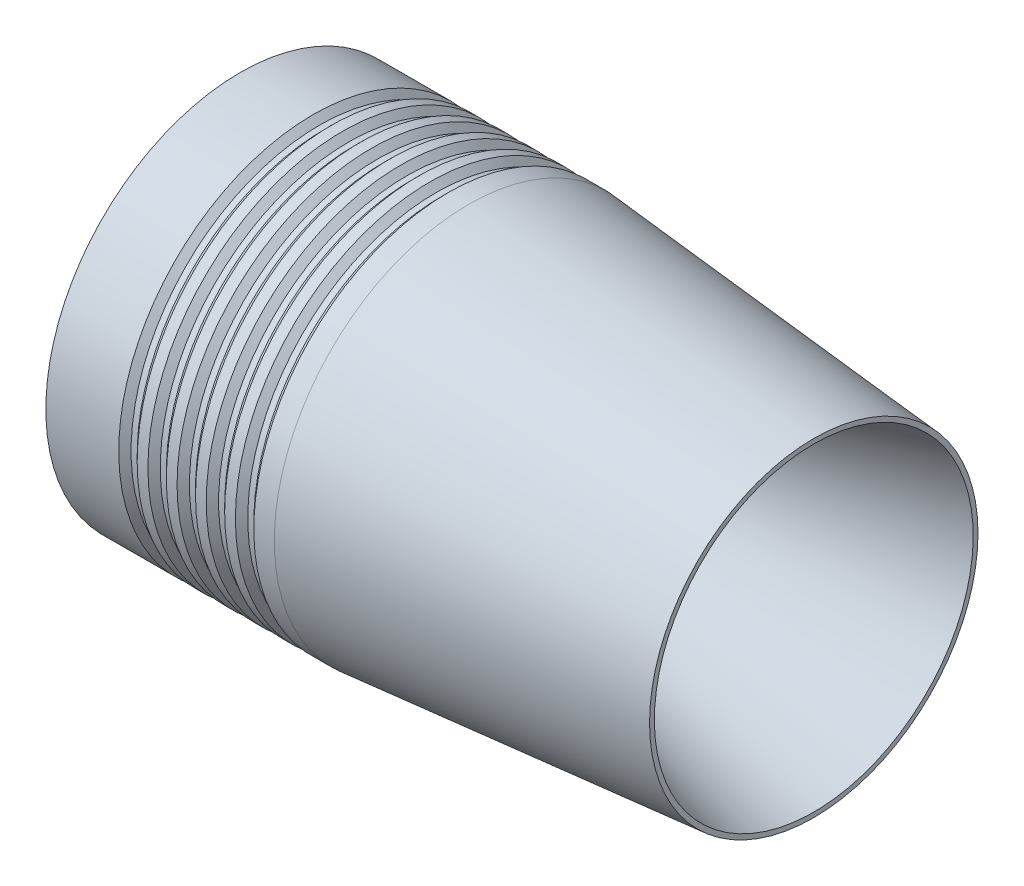
ISO-10303-21;
HEADER;
FILE_DESCRIPTION(('STEP AP214'),'2;1');
FILE_NAME('part.step','',(''),(''),'','','');
FILE_SCHEMA(('AUTOMOTIVE_DESIGN { 1 0 10303 214 1 1 1 1 }'));
ENDSEC;
DATA;
#1=APPLICATION_CONTEXT('core data for automotive mechanical design processes');
#2=APPLICATION_PROTOCOL_DEFINITION('international standard','automotive_design',2000,#1);
#3=PRODUCT_CONTEXT('',#1,'mechanical');
#4=PRODUCT('Part','Part','',(#3));
#5=PRODUCT_RELATED_PRODUCT_CATEGORY('part','',(#4));
#6=PRODUCT_DEFINITION_FORMATION('','',#4);
#7=PRODUCT_DEFINITION_CONTEXT('part definition',#1,'design');
#8=PRODUCT_DEFINITION('design','',#6,#7);
#9=PRODUCT_DEFINITION_SHAPE('','',#8);
#10=(LENGTH_UNIT() NAMED_UNIT(*) SI_UNIT(.MILLI.,.METRE.));
#11=(NAMED_UNIT(*) PLANE_ANGLE_UNIT() SI_UNIT($,.RADIAN.));
#12=(NAMED_UNIT(*) SI_UNIT($,.STERADIAN.) SOLID_ANGLE_UNIT());
#13=UNCERTAINTY_MEASURE_WITH_UNIT(LENGTH_MEASURE(1.E-05),#10,'distance_accuracy_value','');
#14=(GEOMETRIC_REPRESENTATION_CONTEXT(3) GLOBAL_UNCERTAINTY_ASSIGNED_CONTEXT((#13)) GLOBAL_UNIT_ASSIGNED_CONTEXT((#10,
#11,#12)) REPRESENTATION_CONTEXT('',''));
#15=CARTESIAN_POINT('',(0.,0.,0.));
#16=DIRECTION('',(0.,0.,1.));
#17=DIRECTION('',(1.,0.,0.));
#18=AXIS2_PLACEMENT_3D('',#15,#16,#17);
#19=CARTESIAN_POINT('',(0.,0.,0.));
#20=DIRECTION('',(1.,0.,0.));
#21=DIRECTION('',(0.,1.,0.));
#22=AXIS2_PLACEMENT_3D('',#19,#20,#21);
#23=CYLINDRICAL_SURFACE('',#22,50.8);
#24=CARTESIAN_POINT('',(-12.9667000000001,0.,0.));
#25=DIRECTION('',(1.,0.,0.));
#26=DIRECTION('',(0.,0.,-1.));
#27=AXIS2_PLACEMENT_3D('',#24,#25,#26);
#28=CIRCLE('',#27,50.8);
#29=CARTESIAN_POINT('',(-12.9667000000001,0.,-50.8));
#30=VERTEX_POINT('',#29);
#31=EDGE_CURVE('E105',#30,#30,#28,.T.);
#32=ORIENTED_EDGE('',*,*,#31,.T.);
#33=EDGE_LOOP('',(#32));
#34=FACE_BOUND('',#33,.T.);
#35=CARTESIAN_POINT('',(-10.16,0.,0.));
#36=DIRECTION('',(1.,0.,0.));
#37=DIRECTION('',(0.,0.,-1.));
#38=AXIS2_PLACEMENT_3D('',#35,#36,#37);
#39=CIRCLE('',#38,50.8);
#40=CARTESIAN_POINT('',(-10.16,0.,-50.8));
#41=VERTEX_POINT('',#40);
#42=EDGE_CURVE('E120',#41,#41,#39,.T.);
#43=ORIENTED_EDGE('',*,*,#42,.F.);
#44=EDGE_LOOP('',(#43));
#45=FACE_BOUND('',#44,.T.);
#46=ADVANCED_FACE('F34',(#34,#45),#23,.T.);
#47=CARTESIAN_POINT('',(-20.5867000000001,0.,0.));
#48=DIRECTION('',(1.,0.,0.));
#49=DIRECTION('',(0.,0.,-1.));
#50=AXIS2_PLACEMENT_3D('',#47,#48,#49);
#51=CIRCLE('',#50,50.8);
#52=CARTESIAN_POINT('',(-20.5867000000001,0.,-50.8));
#53=VERTEX_POINT('',#52);
#54=EDGE_CURVE('E93',#53,#53,#51,.T.);
#55=ORIENTED_EDGE('',*,*,#54,.T.);
#56=EDGE_LOOP('',(#55));
#57=FACE_BOUND('',#56,.T.);
#58=CARTESIAN_POINT('',(-17.78,0.,0.));
#59=DIRECTION('',(1.,0.,0.));
#60=DIRECTION('',(0.,0.,-1.));
#61=AXIS2_PLACEMENT_3D('',#58,#59,#60);
#62=CIRCLE('',#61,50.8);
#63=CARTESIAN_POINT('',(-17.78,0.,-50.8));
#64=VERTEX_POINT('',#63);
#65=EDGE_CURVE('E108',#64,#64,#62,.T.);
#66=ORIENTED_EDGE('',*,*,#65,.F.);
#67=EDGE_LOOP('',(#66));
#68=FACE_BOUND('',#67,.T.);
#69=ADVANCED_FACE('F143',(#57,#68),#23,.T.);
#70=CARTESIAN_POINT('',(-28.2067000000001,0.,0.));
#71=DIRECTION('',(1.,0.,0.));
#72=DIRECTION('',(0.,0.,-1.));
#73=AXIS2_PLACEMENT_3D('',#70,#71,#72);
#74=CIRCLE('',#73,50.8);
#75=CARTESIAN_POINT('',(-28.2067000000001,0.,-50.8));
#76=VERTEX_POINT('',#75);
#77=EDGE_CURVE('E81',#76,#76,#74,.T.);
#78=ORIENTED_EDGE('',*,*,#77,.T.);
#79=EDGE_LOOP('',(#78));
#80=FACE_BOUND('',#79,.T.);
#81=CARTESIAN_POINT('',(-25.4,0.,0.));
#82=DIRECTION('',(1.,0.,0.));
#83=DIRECTION('',(0.,0.,-1.));
#84=AXIS2_PLACEMENT_3D('',#81,#82,#83);
#85=CIRCLE('',#84,50.8);
#86=CARTESIAN_POINT('',(-25.4,0.,-50.8));
#87=VERTEX_POINT('',#86);
#88=EDGE_CURVE('E96',#87,#87,#85,.T.);
#89=ORIENTED_EDGE('',*,*,#88,.F.);
#90=EDGE_LOOP('',(#89));
#91=FACE_BOUND('',#90,.T.);
#92=ADVANCED_FACE('F149',(#80,#91),#23,.T.);
#93=CARTESIAN_POINT('',(-35.8267000000001,0.,0.));
#94=DIRECTION('',(1.,0.,0.));
#95=DIRECTION('',(0.,0.,-1.));
#96=AXIS2_PLACEMENT_3D('',#93,#94,#95);
#97=CIRCLE('',#96,50.8);
#98=CARTESIAN_POINT('',(-35.8267000000001,0.,-50.8));
#99=VERTEX_POINT('',#98);
#100=EDGE_CURVE('E69',#99,#99,#97,.T.);
#101=ORIENTED_EDGE('',*,*,#100,.T.);
#102=EDGE_LOOP('',(#101));
#103=FACE_BOUND('',#102,.T.);
#104=CARTESIAN_POINT('',(-33.02,0.,0.));
#105=DIRECTION('',(1.,0.,0.));
#106=DIRECTION('',(0.,0.,-1.));
#107=AXIS2_PLACEMENT_3D('',#104,#105,#106);
#108=CIRCLE('',#107,50.8);
#109=CARTESIAN_POINT('',(-33.02,0.,-50.8));
#110=VERTEX_POINT('',#109);
#111=EDGE_CURVE('E84',#110,#110,#108,.T.);
#112=ORIENTED_EDGE('',*,*,#111,.F.);
#113=EDGE_LOOP('',(#112));
#114=FACE_BOUND('',#113,.T.);
#115=ADVANCED_FACE('F166',(#103,#114),#23,.T.);
#116=CARTESIAN_POINT('',(-59.69,0.,0.));
#117=DIRECTION('',(1.,0.,0.));
#118=DIRECTION('',(0.,1.,0.));
#119=AXIS2_PLACEMENT_3D('',#116,#117,#118);
#120=CIRCLE('',#119,50.8);
#121=CARTESIAN_POINT('',(-59.69,50.8,0.));
#122=VERTEX_POINT('',#121);
#123=EDGE_CURVE('E42',#122,#122,#120,.T.);
#124=ORIENTED_EDGE('',*,*,#123,.T.);
#125=EDGE_LOOP('',(#124));
#126=FACE_BOUND('',#125,.T.);
#127=CARTESIAN_POINT('',(-40.64,0.,0.));
#128=DIRECTION('',(1.,0.,0.));
#129=DIRECTION('',(0.,0.,-1.));
#130=AXIS2_PLACEMENT_3D('',#127,#128,#129);
#131=CIRCLE('',#130,50.8);
#132=CARTESIAN_POINT('',(-40.64,0.,-50.8));
#133=VERTEX_POINT('',#132);
#134=EDGE_CURVE('E72',#133,#133,#131,.T.);
#135=ORIENTED_EDGE('',*,*,#134,.F.);
#136=EDGE_LOOP('',(#135));
#137=FACE_BOUND('',#136,.T.);
#138=ADVANCED_FACE('F156',(#126,#137),#23,.T.);
#139=CARTESIAN_POINT('',(0.,0.,0.));
#140=DIRECTION('',(-1.,0.,0.));
#141=DIRECTION('',(0.,-1.,0.));
#142=AXIS2_PLACEMENT_3D('',#139,#140,#141);
#143=CONICAL_SURFACE('',#142,50.8,0.0872664625997168);
#144=CARTESIAN_POINT('',(90.17,0.,0.));
#145=DIRECTION('',(1.,0.,0.));
#146=DIRECTION('',(0.,1.,0.));
#147=AXIS2_PLACEMENT_3D('',#144,#145,#146);
#148=CIRCLE('',#147,42.9111472098674);
#149=CARTESIAN_POINT('',(90.17,42.9111472098674,0.));
#150=VERTEX_POINT('',#149);
#151=EDGE_CURVE('E51',#150,#150,#148,.T.);
#152=ORIENTED_EDGE('',*,*,#151,.F.);
#153=EDGE_LOOP('',(#152));
#154=FACE_BOUND('',#153,.T.);
#155=CARTESIAN_POINT('',(0.,0.,0.));
#156=DIRECTION('',(1.,0.,0.));
#157=DIRECTION('',(0.,1.,0.));
#158=AXIS2_PLACEMENT_3D('',#155,#156,#157);
#159=CIRCLE('',#158,50.8);
#160=CARTESIAN_POINT('',(0.,50.8,0.));
#161=VERTEX_POINT('',#160);
#162=EDGE_CURVE('E10',#161,#161,#159,.T.);
#163=ORIENTED_EDGE('',*,*,#162,.T.);
#164=EDGE_LOOP('',(#163));
#165=FACE_BOUND('',#164,.T.);
#166=ADVANCED_FACE('F36',(#154,#165),#143,.T.);
#167=CARTESIAN_POINT('',(-5.34670000000008,0.,0.));
#168=DIRECTION('',(1.,0.,0.));
#169=DIRECTION('',(0.,0.,-1.));
#170=AXIS2_PLACEMENT_3D('',#167,#168,#169);
#171=CIRCLE('',#170,50.8);
#172=CARTESIAN_POINT('',(-5.34670000000008,0.,-50.8));
#173=VERTEX_POINT('',#172);
#174=EDGE_CURVE('E117',#173,#173,#171,.T.);
#175=ORIENTED_EDGE('',*,*,#174,.T.);
#176=EDGE_LOOP('',(#175));
#177=FACE_BOUND('',#176,.T.);
#178=ORIENTED_EDGE('',*,*,#162,.F.);
#179=EDGE_LOOP('',(#178));
#180=FACE_BOUND('',#179,.T.);
#181=ADVANCED_FACE('F145',(#177,#180),#23,.T.);
#182=CARTESIAN_POINT('',(-59.69,0.,0.));
#183=DIRECTION('',(1.,0.,0.));
#184=DIRECTION('',(0.,1.,0.));
#185=AXIS2_PLACEMENT_3D('',#182,#183,#184);
#186=PLANE('',#185);
#187=ORIENTED_EDGE('',*,*,#123,.F.);
#188=EDGE_LOOP('',(#187));
#189=FACE_BOUND('',#188,.T.);
#190=CARTESIAN_POINT('',(-59.69,0.,0.));
#191=DIRECTION('',(1.,0.,0.));
#192=DIRECTION('',(0.,1.,0.));
#193=AXIS2_PLACEMENT_3D('',#190,#191,#192);
#194=CIRCLE('',#193,44.45);
#195=CARTESIAN_POINT('',(-59.69,44.45,0.));
#196=VERTEX_POINT('',#195);
#197=EDGE_CURVE('E60',#196,#196,#194,.T.);
#198=ORIENTED_EDGE('',*,*,#197,.T.);
#199=EDGE_LOOP('',(#198));
#200=FACE_BOUND('',#199,.T.);
#201=ADVANCED_FACE('F154',(#189,#200),#186,.F.);
#202=CARTESIAN_POINT('',(1.78084856857237,0.,0.));
#203=DIRECTION('',(1.,0.,0.));
#204=DIRECTION('',(0.,1.,0.));
#205=AXIS2_PLACEMENT_3D('',#202,#203,#204);
#206=CONICAL_SURFACE('',#205,17.8882556763972,0.262685253079923);
#207=CARTESIAN_POINT('',(25.4,0.,0.));
#208=DIRECTION('',(1.,0.,0.));
#209=DIRECTION('',(0.,1.,0.));
#210=AXIS2_PLACEMENT_3D('',#207,#208,#209);
#211=CIRCLE('',#210,24.2394191763448);
#212=CARTESIAN_POINT('',(25.4,24.2394191763448,0.));
#213=VERTEX_POINT('',#212);
#214=EDGE_CURVE('E38',#213,#213,#211,.T.);
#215=ORIENTED_EDGE('',*,*,#214,.F.);
#216=EDGE_LOOP('',(#215));
#217=FACE_BOUND('',#216,.T.);
#218=CARTESIAN_POINT('',(90.17,0.,0.));
#219=DIRECTION('',(1.,0.,0.));
#220=DIRECTION('',(0.,1.,0.));
#221=AXIS2_PLACEMENT_3D('',#218,#219,#220);
#222=CIRCLE('',#221,41.656);
#223=CARTESIAN_POINT('',(90.17,41.656,0.));
#224=VERTEX_POINT('',#223);
#225=EDGE_CURVE('E46',#224,#224,#222,.T.);
#226=ORIENTED_EDGE('',*,*,#225,.T.);
#227=EDGE_LOOP('',(#226));
#228=FACE_BOUND('',#227,.T.);
#229=ADVANCED_FACE('F161',(#217,#228),#206,.F.);
#230=CARTESIAN_POINT('',(90.17,0.,0.));
#231=DIRECTION('',(1.,0.,0.));
#232=DIRECTION('',(0.,1.,0.));
#233=AXIS2_PLACEMENT_3D('',#230,#231,#232);
#234=PLANE('',#233);
#235=ORIENTED_EDGE('',*,*,#151,.T.);
#236=EDGE_LOOP('',(#235));
#237=FACE_BOUND('',#236,.T.);
#238=ORIENTED_EDGE('',*,*,#225,.F.);
#239=EDGE_LOOP('',(#238));
#240=FACE_BOUND('',#239,.T.);
#241=ADVANCED_FACE('F216',(#237,#240),#234,.T.);
#242=CARTESIAN_POINT('',(25.4,0.,0.));
#243=DIRECTION('',(1.,0.,0.));
#244=DIRECTION('',(0.,1.,0.));
#245=AXIS2_PLACEMENT_3D('',#242,#243,#244);
#246=PLANE('',#245);
#247=ORIENTED_EDGE('',*,*,#214,.T.);
#248=EDGE_LOOP('',(#247));
#249=FACE_BOUND('',#248,.T.);
#250=CARTESIAN_POINT('',(25.4,0.,0.));
#251=DIRECTION('',(-1.,0.,0.));
#252=DIRECTION('',(0.,-1.,0.));
#253=AXIS2_PLACEMENT_3D('',#250,#251,#252);
#254=CIRCLE('',#253,31.75);
#255=CARTESIAN_POINT('',(25.4,-31.75,0.));
#256=VERTEX_POINT('',#255);
#257=EDGE_CURVE('E54',#256,#256,#254,.T.);
#258=ORIENTED_EDGE('',*,*,#257,.T.);
#259=EDGE_LOOP('',(#258));
#260=FACE_BOUND('',#259,.T.);
#261=ADVANCED_FACE('F212',(#249,#260),#246,.F.);
#262=CARTESIAN_POINT('',(-29.0855384380722,0.,0.));
#263=DIRECTION('',(-1.,0.,0.));
#264=DIRECTION('',(0.,-1.,0.));
#265=AXIS2_PLACEMENT_3D('',#262,#263,#264);
#266=CONICAL_SURFACE('',#265,35.56,0.0698131700797735);
#267=ORIENTED_EDGE('',*,*,#257,.F.);
#268=EDGE_LOOP('',(#267));
#269=FACE_BOUND('',#268,.T.);
#270=CARTESIAN_POINT('',(-29.0855384380722,0.,0.));
#271=DIRECTION('',(-1.,0.,0.));
#272=DIRECTION('',(0.,-1.,0.));
#273=AXIS2_PLACEMENT_3D('',#270,#271,#272);
#274=CIRCLE('',#273,35.56);
#275=CARTESIAN_POINT('',(-29.0855384380722,-35.56,0.));
#276=VERTEX_POINT('',#275);
#277=EDGE_CURVE('E57',#276,#276,#274,.T.);
#278=ORIENTED_EDGE('',*,*,#277,.T.);
#279=EDGE_LOOP('',(#278));
#280=FACE_BOUND('',#279,.T.);
#281=ADVANCED_FACE('F208',(#269,#280),#266,.F.);
#282=CARTESIAN_POINT('',(-50.8,0.,0.));
#283=DIRECTION('',(-1.,0.,0.));
#284=DIRECTION('',(0.,-1.,0.));
#285=AXIS2_PLACEMENT_3D('',#282,#283,#284);
#286=CYLINDRICAL_SURFACE('',#285,35.56);
#287=ORIENTED_EDGE('',*,*,#277,.F.);
#288=EDGE_LOOP('',(#287));
#289=FACE_BOUND('',#288,.T.);
#290=CARTESIAN_POINT('',(-42.6454767554289,0.,0.));
#291=DIRECTION('',(1.,0.,0.));
#292=DIRECTION('',(0.,1.,0.));
#293=AXIS2_PLACEMENT_3D('',#290,#291,#292);
#294=CIRCLE('',#293,35.56);
#295=CARTESIAN_POINT('',(-42.6454767554289,35.56,0.));
#296=VERTEX_POINT('',#295);
#297=EDGE_CURVE('E63',#296,#296,#294,.F.);
#298=ORIENTED_EDGE('',*,*,#297,.T.);
#299=EDGE_LOOP('',(#298));
#300=FACE_BOUND('',#299,.T.);
#301=ADVANCED_FACE('F203',(#289,#300),#286,.F.);
#302=CARTESIAN_POINT('',(0.,0.,0.));
#303=DIRECTION('',(1.,0.,0.));
#304=DIRECTION('',(0.,1.,0.));
#305=AXIS2_PLACEMENT_3D('',#302,#303,#304);
#306=CYLINDRICAL_SURFACE('',#305,44.45);
#307=CARTESIAN_POINT('',(-42.6454767554289,0.,0.));
#308=DIRECTION('',(1.,0.,0.));
#309=DIRECTION('',(0.,1.,0.));
#310=AXIS2_PLACEMENT_3D('',#307,#308,#309);
#311=CIRCLE('',#310,44.45);
#312=CARTESIAN_POINT('',(-42.6454767554289,44.45,0.));
#313=VERTEX_POINT('',#312);
#314=EDGE_CURVE('E66',#313,#313,#311,.T.);
#315=ORIENTED_EDGE('',*,*,#314,.T.);
#316=EDGE_LOOP('',(#315));
#317=FACE_BOUND('',#316,.T.);
#318=ORIENTED_EDGE('',*,*,#197,.F.);
#319=EDGE_LOOP('',(#318));
#320=FACE_BOUND('',#319,.T.);
#321=ADVANCED_FACE('F197',(#317,#320),#306,.F.);
#322=CARTESIAN_POINT('',(-42.6454767554289,31.75,0.));
#323=DIRECTION('',(1.,0.,0.));
#324=DIRECTION('',(0.,1.,0.));
#325=AXIS2_PLACEMENT_3D('',#322,#323,#324);
#326=PLANE('',#325);
#327=ORIENTED_EDGE('',*,*,#314,.F.);
#328=EDGE_LOOP('',(#327));
#329=FACE_BOUND('',#328,.T.);
#330=ORIENTED_EDGE('',*,*,#297,.F.);
#331=EDGE_LOOP('',(#330));
#332=FACE_BOUND('',#331,.T.);
#333=ADVANCED_FACE('F191',(#329,#332),#326,.F.);
#334=CARTESIAN_POINT('',(-37.4396,0.,0.));
#335=DIRECTION('',(1.,0.,0.));
#336=DIRECTION('',(0.,0.,-1.));
#337=AXIS2_PLACEMENT_3D('',#334,#335,#336);
#338=CONICAL_SURFACE('',#337,49.1871,0.785398163397457);
#339=ORIENTED_EDGE('',*,*,#100,.F.);
#340=EDGE_LOOP('',(#339));
#341=FACE_BOUND('',#340,.T.);
#342=CARTESIAN_POINT('',(-37.4396,0.,0.));
#343=DIRECTION('',(1.,0.,0.));
#344=DIRECTION('',(0.,0.,-1.));
#345=AXIS2_PLACEMENT_3D('',#342,#343,#344);
#346=CIRCLE('',#345,49.1871);
#347=CARTESIAN_POINT('',(-37.4396,0.,-49.1871));
#348=VERTEX_POINT('',#347);
#349=EDGE_CURVE('E78',#348,#348,#346,.T.);
#350=ORIENTED_EDGE('',*,*,#349,.T.);
#351=EDGE_LOOP('',(#350));
#352=FACE_BOUND('',#351,.T.);
#353=ADVANCED_FACE('F180',(#341,#352),#338,.T.);
#354=CARTESIAN_POINT('',(-39.0271,0.,0.));
#355=DIRECTION('',(-1.,0.,0.));
#356=DIRECTION('',(0.,0.,1.));
#357=AXIS2_PLACEMENT_3D('',#354,#355,#356);
#358=CONICAL_SURFACE('',#357,49.1871,0.78539816339745);
#359=ORIENTED_EDGE('',*,*,#134,.T.);
#360=EDGE_LOOP('',(#359));
#361=FACE_BOUND('',#360,.T.);
#362=CARTESIAN_POINT('',(-39.0271,0.,0.));
#363=DIRECTION('',(1.,0.,0.));
#364=DIRECTION('',(0.,0.,-1.));
#365=AXIS2_PLACEMENT_3D('',#362,#363,#364);
#366=CIRCLE('',#365,49.1871);
#367=CARTESIAN_POINT('',(-39.0271,0.,-49.1871));
#368=VERTEX_POINT('',#367);
#369=EDGE_CURVE('E75',#368,#368,#366,.T.);
#370=ORIENTED_EDGE('',*,*,#369,.F.);
#371=EDGE_LOOP('',(#370));
#372=FACE_BOUND('',#371,.T.);
#373=ADVANCED_FACE('F176',(#361,#372),#358,.T.);
#374=CARTESIAN_POINT('',(0.,0.,0.));
#375=DIRECTION('',(1.,0.,0.));
#376=DIRECTION('',(0.,0.,-1.));
#377=AXIS2_PLACEMENT_3D('',#374,#375,#376);
#378=CYLINDRICAL_SURFACE('',#377,49.1871);
#379=ORIENTED_EDGE('',*,*,#369,.T.);
#380=EDGE_LOOP('',(#379));
#381=FACE_BOUND('',#380,.T.);
#382=ORIENTED_EDGE('',*,*,#349,.F.);
#383=EDGE_LOOP('',(#382));
#384=FACE_BOUND('',#383,.T.);
#385=ADVANCED_FACE('F179',(#381,#384),#378,.T.);
#386=CARTESIAN_POINT('',(-29.8196,0.,0.));
#387=DIRECTION('',(1.,0.,0.));
#388=DIRECTION('',(0.,0.,-1.));
#389=AXIS2_PLACEMENT_3D('',#386,#387,#388);
#390=CONICAL_SURFACE('',#389,49.1871,0.785398163397457);
#391=ORIENTED_EDGE('',*,*,#77,.F.);
#392=EDGE_LOOP('',(#391));
#393=FACE_BOUND('',#392,.T.);
#394=CARTESIAN_POINT('',(-29.8196,0.,0.));
#395=DIRECTION('',(1.,0.,0.));
#396=DIRECTION('',(0.,0.,-1.));
#397=AXIS2_PLACEMENT_3D('',#394,#395,#396);
#398=CIRCLE('',#397,49.1871);
#399=CARTESIAN_POINT('',(-29.8196,0.,-49.1871));
#400=VERTEX_POINT('',#399);
#401=EDGE_CURVE('E90',#400,#400,#398,.T.);
#402=ORIENTED_EDGE('',*,*,#401,.T.);
#403=EDGE_LOOP('',(#402));
#404=FACE_BOUND('',#403,.T.);
#405=ADVANCED_FACE('F186',(#393,#404),#390,.T.);
#406=CARTESIAN_POINT('',(-31.4071,0.,0.));
#407=DIRECTION('',(-1.,0.,0.));
#408=DIRECTION('',(0.,0.,1.));
#409=AXIS2_PLACEMENT_3D('',#406,#407,#408);
#410=CONICAL_SURFACE('',#409,49.1871,0.78539816339745);
#411=ORIENTED_EDGE('',*,*,#111,.T.);
#412=EDGE_LOOP('',(#411));
#413=FACE_BOUND('',#412,.T.);
#414=CARTESIAN_POINT('',(-31.4071,0.,0.));
#415=DIRECTION('',(1.,0.,0.));
#416=DIRECTION('',(0.,0.,-1.));
#417=AXIS2_PLACEMENT_3D('',#414,#415,#416);
#418=CIRCLE('',#417,49.1871);
#419=CARTESIAN_POINT('',(-31.4071,0.,-49.1871));
#420=VERTEX_POINT('',#419);
#421=EDGE_CURVE('E87',#420,#420,#418,.T.);
#422=ORIENTED_EDGE('',*,*,#421,.F.);
#423=EDGE_LOOP('',(#422));
#424=FACE_BOUND('',#423,.T.);
#425=ADVANCED_FACE('F322',(#413,#424),#410,.T.);
#426=CARTESIAN_POINT('',(7.62,0.,0.));
#427=DIRECTION('',(1.,0.,0.));
#428=DIRECTION('',(0.,0.,-1.));
#429=AXIS2_PLACEMENT_3D('',#426,#427,#428);
#430=CYLINDRICAL_SURFACE('',#429,49.1871);
#431=ORIENTED_EDGE('',*,*,#421,.T.);
#432=EDGE_LOOP('',(#431));
#433=FACE_BOUND('',#432,.T.);
#434=ORIENTED_EDGE('',*,*,#401,.F.);
#435=EDGE_LOOP('',(#434));
#436=FACE_BOUND('',#435,.T.);
#437=ADVANCED_FACE('F332',(#433,#436),#430,.T.);
#438=CARTESIAN_POINT('',(-22.1996,0.,0.));
#439=DIRECTION('',(1.,0.,0.));
#440=DIRECTION('',(0.,0.,-1.));
#441=AXIS2_PLACEMENT_3D('',#438,#439,#440);
#442=CONICAL_SURFACE('',#441,49.1871,0.785398163397457);
#443=ORIENTED_EDGE('',*,*,#54,.F.);
#444=EDGE_LOOP('',(#443));
#445=FACE_BOUND('',#444,.T.);
#446=CARTESIAN_POINT('',(-22.1996,0.,0.));
#447=DIRECTION('',(1.,0.,0.));
#448=DIRECTION('',(0.,0.,-1.));
#449=AXIS2_PLACEMENT_3D('',#446,#447,#448);
#450=CIRCLE('',#449,49.1871);
#451=CARTESIAN_POINT('',(-22.1996,0.,-49.1871));
#452=VERTEX_POINT('',#451);
#453=EDGE_CURVE('E102',#452,#452,#450,.T.);
#454=ORIENTED_EDGE('',*,*,#453,.T.);
#455=EDGE_LOOP('',(#454));
#456=FACE_BOUND('',#455,.T.);
#457=ADVANCED_FACE('F342',(#445,#456),#442,.T.);
#458=CARTESIAN_POINT('',(-23.7871,0.,0.));
#459=DIRECTION('',(-1.,0.,0.));
#460=DIRECTION('',(0.,0.,1.));
#461=AXIS2_PLACEMENT_3D('',#458,#459,#460);
#462=CONICAL_SURFACE('',#461,49.1871,0.78539816339745);
#463=ORIENTED_EDGE('',*,*,#88,.T.);
#464=EDGE_LOOP('',(#463));
#465=FACE_BOUND('',#464,.T.);
#466=CARTESIAN_POINT('',(-23.7871,0.,0.));
#467=DIRECTION('',(1.,0.,0.));
#468=DIRECTION('',(0.,0.,-1.));
#469=AXIS2_PLACEMENT_3D('',#466,#467,#468);
#470=CIRCLE('',#469,49.1871);
#471=CARTESIAN_POINT('',(-23.7871,0.,-49.1871));
#472=VERTEX_POINT('',#471);
#473=EDGE_CURVE('E99',#472,#472,#470,.T.);
#474=ORIENTED_EDGE('',*,*,#473,.F.);
#475=EDGE_LOOP('',(#474));
#476=FACE_BOUND('',#475,.T.);
#477=ADVANCED_FACE('F352',(#465,#476),#462,.T.);
#478=CARTESIAN_POINT('',(15.24,0.,0.));
#479=DIRECTION('',(1.,0.,0.));
#480=DIRECTION('',(0.,0.,-1.));
#481=AXIS2_PLACEMENT_3D('',#478,#479,#480);
#482=CYLINDRICAL_SURFACE('',#481,49.1871);
#483=ORIENTED_EDGE('',*,*,#473,.T.);
#484=EDGE_LOOP('',(#483));
#485=FACE_BOUND('',#484,.T.);
#486=ORIENTED_EDGE('',*,*,#453,.F.);
#487=EDGE_LOOP('',(#486));
#488=FACE_BOUND('',#487,.T.);
#489=ADVANCED_FACE('F362',(#485,#488),#482,.T.);
#490=CARTESIAN_POINT('',(-14.5796,0.,0.));
#491=DIRECTION('',(1.,0.,0.));
#492=DIRECTION('',(0.,0.,-1.));
#493=AXIS2_PLACEMENT_3D('',#490,#491,#492);
#494=CONICAL_SURFACE('',#493,49.1871,0.785398163397457);
#495=ORIENTED_EDGE('',*,*,#31,.F.);
#496=EDGE_LOOP('',(#495));
#497=FACE_BOUND('',#496,.T.);
#498=CARTESIAN_POINT('',(-14.5796,0.,0.));
#499=DIRECTION('',(1.,0.,0.));
#500=DIRECTION('',(0.,0.,-1.));
#501=AXIS2_PLACEMENT_3D('',#498,#499,#500);
#502=CIRCLE('',#501,49.1871);
#503=CARTESIAN_POINT('',(-14.5796,0.,-49.1871));
#504=VERTEX_POINT('',#503);
#505=EDGE_CURVE('E114',#504,#504,#502,.T.);
#506=ORIENTED_EDGE('',*,*,#505,.T.);
#507=EDGE_LOOP('',(#506));
#508=FACE_BOUND('',#507,.T.);
#509=ADVANCED_FACE('F372',(#497,#508),#494,.T.);
#510=CARTESIAN_POINT('',(-16.1671,0.,0.));
#511=DIRECTION('',(-1.,0.,0.));
#512=DIRECTION('',(0.,0.,1.));
#513=AXIS2_PLACEMENT_3D('',#510,#511,#512);
#514=CONICAL_SURFACE('',#513,49.1871,0.78539816339745);
#515=ORIENTED_EDGE('',*,*,#65,.T.);
#516=EDGE_LOOP('',(#515));
#517=FACE_BOUND('',#516,.T.);
#518=CARTESIAN_POINT('',(-16.1671,0.,0.));
#519=DIRECTION('',(1.,0.,0.));
#520=DIRECTION('',(0.,0.,-1.));
#521=AXIS2_PLACEMENT_3D('',#518,#519,#520);
#522=CIRCLE('',#521,49.1871);
#523=CARTESIAN_POINT('',(-16.1671,0.,-49.1871));
#524=VERTEX_POINT('',#523);
#525=EDGE_CURVE('E111',#524,#524,#522,.T.);
#526=ORIENTED_EDGE('',*,*,#525,.F.);
#527=EDGE_LOOP('',(#526));
#528=FACE_BOUND('',#527,.T.);
#529=ADVANCED_FACE('F382',(#517,#528),#514,.T.);
#530=CARTESIAN_POINT('',(22.86,0.,0.));
#531=DIRECTION('',(1.,0.,0.));
#532=DIRECTION('',(0.,0.,-1.));
#533=AXIS2_PLACEMENT_3D('',#530,#531,#532);
#534=CYLINDRICAL_SURFACE('',#533,49.1871);
#535=ORIENTED_EDGE('',*,*,#525,.T.);
#536=EDGE_LOOP('',(#535));
#537=FACE_BOUND('',#536,.T.);
#538=ORIENTED_EDGE('',*,*,#505,.F.);
#539=EDGE_LOOP('',(#538));
#540=FACE_BOUND('',#539,.T.);
#541=ADVANCED_FACE('F392',(#537,#540),#534,.T.);
#542=CARTESIAN_POINT('',(-6.95960000000005,0.,0.));
#543=DIRECTION('',(1.,0.,0.));
#544=DIRECTION('',(0.,0.,-1.));
#545=AXIS2_PLACEMENT_3D('',#542,#543,#544);
#546=CONICAL_SURFACE('',#545,49.1871,0.785398163397457);
#547=ORIENTED_EDGE('',*,*,#174,.F.);
#548=EDGE_LOOP('',(#547));
#549=FACE_BOUND('',#548,.T.);
#550=CARTESIAN_POINT('',(-6.95960000000005,0.,0.));
#551=DIRECTION('',(1.,0.,0.));
#552=DIRECTION('',(0.,0.,-1.));
#553=AXIS2_PLACEMENT_3D('',#550,#551,#552);
#554=CIRCLE('',#553,49.1871);
#555=CARTESIAN_POINT('',(-6.95960000000005,0.,-49.1871));
#556=VERTEX_POINT('',#555);
#557=EDGE_CURVE('E126',#556,#556,#554,.T.);
#558=ORIENTED_EDGE('',*,*,#557,.T.);
#559=EDGE_LOOP('',(#558));
#560=FACE_BOUND('',#559,.T.);
#561=ADVANCED_FACE('F130',(#549,#560),#546,.T.);
#562=CARTESIAN_POINT('',(-8.54710000000002,0.,0.));
#563=DIRECTION('',(-1.,0.,0.));
#564=DIRECTION('',(0.,0.,1.));
#565=AXIS2_PLACEMENT_3D('',#562,#563,#564);
#566=CONICAL_SURFACE('',#565,49.1871,0.78539816339745);
#567=ORIENTED_EDGE('',*,*,#42,.T.);
#568=EDGE_LOOP('',(#567));
#569=FACE_BOUND('',#568,.T.);
#570=CARTESIAN_POINT('',(-8.54710000000002,0.,0.));
#571=DIRECTION('',(1.,0.,0.));
#572=DIRECTION('',(0.,0.,-1.));
#573=AXIS2_PLACEMENT_3D('',#570,#571,#572);
#574=CIRCLE('',#573,49.1871);
#575=CARTESIAN_POINT('',(-8.54710000000002,0.,-49.1871));
#576=VERTEX_POINT('',#575);
#577=EDGE_CURVE('E123',#576,#576,#574,.T.);
#578=ORIENTED_EDGE('',*,*,#577,.F.);
#579=EDGE_LOOP('',(#578));
#580=FACE_BOUND('',#579,.T.);
#581=ADVANCED_FACE('F134',(#569,#580),#566,.T.);
#582=CARTESIAN_POINT('',(30.48,0.,0.));
#583=DIRECTION('',(1.,0.,0.));
#584=DIRECTION('',(0.,0.,-1.));
#585=AXIS2_PLACEMENT_3D('',#582,#583,#584);
#586=CYLINDRICAL_SURFACE('',#585,49.1871);
#587=ORIENTED_EDGE('',*,*,#577,.T.);
#588=EDGE_LOOP('',(#587));
#589=FACE_BOUND('',#588,.T.);
#590=ORIENTED_EDGE('',*,*,#557,.F.);
#591=EDGE_LOOP('',(#590));
#592=FACE_BOUND('',#591,.T.);
#593=ADVANCED_FACE('F132',(#589,#592),#586,.T.);
#594=CLOSED_SHELL('',(#46,#69,#92,#115,#138,#166,#181,#201,#229,#241,#261,#281,#301,#321,#333,
#353,#373,#385,#405,#425,#437,#457,#477,#489,#509,#529,#541,#561,#581,#593));
#595=MANIFOLD_SOLID_BREP('B2',#594);
#596=ADVANCED_BREP_SHAPE_REPRESENTATION('',(#18,#595),#14);
#597=SHAPE_DEFINITION_REPRESENTATION(#9,#596);
ENDSEC;
END-ISO-10303-21;
